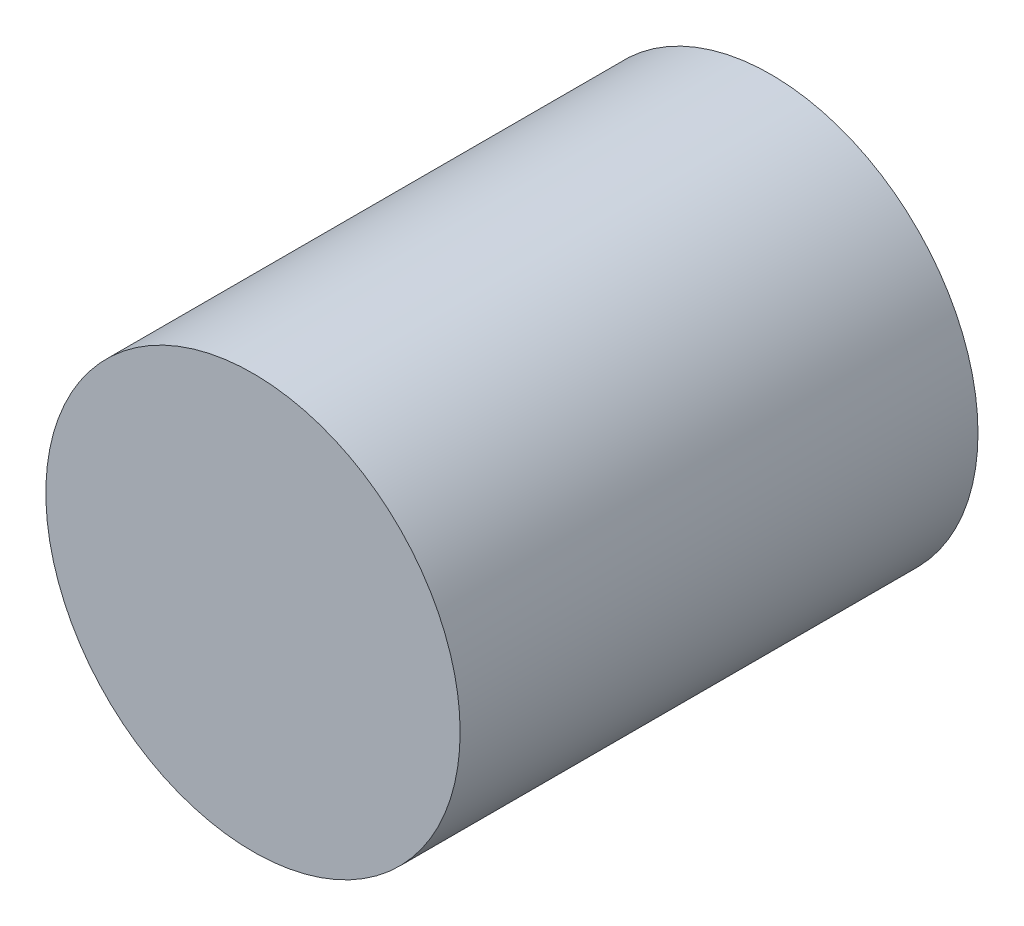
ISO-10303-21;
HEADER;
FILE_DESCRIPTION(('STEP AP214'),'2;1');
FILE_NAME('part.step','',(''),(''),'','','');
FILE_SCHEMA(('AUTOMOTIVE_DESIGN { 1 0 10303 214 1 1 1 1 }'));
ENDSEC;
DATA;
#1=APPLICATION_CONTEXT('core data for automotive mechanical design processes');
#2=APPLICATION_PROTOCOL_DEFINITION('international standard','automotive_design',2000,#1);
#3=PRODUCT_CONTEXT('',#1,'mechanical');
#4=PRODUCT('Part','Part','',(#3));
#5=PRODUCT_RELATED_PRODUCT_CATEGORY('part','',(#4));
#6=PRODUCT_DEFINITION_FORMATION('','',#4);
#7=PRODUCT_DEFINITION_CONTEXT('part definition',#1,'design');
#8=PRODUCT_DEFINITION('design','',#6,#7);
#9=PRODUCT_DEFINITION_SHAPE('','',#8);
#10=(LENGTH_UNIT() NAMED_UNIT(*) SI_UNIT(.MILLI.,.METRE.));
#11=(NAMED_UNIT(*) PLANE_ANGLE_UNIT() SI_UNIT($,.RADIAN.));
#12=(NAMED_UNIT(*) SI_UNIT($,.STERADIAN.) SOLID_ANGLE_UNIT());
#13=UNCERTAINTY_MEASURE_WITH_UNIT(LENGTH_MEASURE(1.E-05),#10,'distance_accuracy_value','');
#14=(GEOMETRIC_REPRESENTATION_CONTEXT(3) GLOBAL_UNCERTAINTY_ASSIGNED_CONTEXT((#13)) GLOBAL_UNIT_ASSIGNED_CONTEXT((#10,
#11,#12)) REPRESENTATION_CONTEXT('',''));
#15=CARTESIAN_POINT('',(0.,0.,0.));
#16=DIRECTION('',(0.,0.,1.));
#17=DIRECTION('',(1.,0.,0.));
#18=AXIS2_PLACEMENT_3D('',#15,#16,#17);
#19=CARTESIAN_POINT('',(-15.067024343169,-8.81581211568398,100.));
#20=DIRECTION('',(0.,0.,-1.));
#21=DIRECTION('',(-1.,0.,0.));
#22=AXIS2_PLACEMENT_3D('',#19,#20,#21);
#23=CYLINDRICAL_SURFACE('',#22,40.);
#24=CARTESIAN_POINT('',(-15.067024343169,-8.81581211568398,100.));
#25=DIRECTION('',(0.,0.,1.));
#26=DIRECTION('',(1.,0.,0.));
#27=AXIS2_PLACEMENT_3D('',#24,#25,#26);
#28=CIRCLE('',#27,40.);
#29=CARTESIAN_POINT('',(24.932975656831,-8.81581211568398,100.));
#30=VERTEX_POINT('',#29);
#31=EDGE_CURVE('E10',#30,#30,#28,.T.);
#32=ORIENTED_EDGE('',*,*,#31,.F.);
#33=EDGE_LOOP('',(#32));
#34=FACE_BOUND('',#33,.T.);
#35=CARTESIAN_POINT('',(-15.067024343169,-8.81581211568398,0.));
#36=DIRECTION('',(0.,0.,1.));
#37=DIRECTION('',(1.,0.,0.));
#38=AXIS2_PLACEMENT_3D('',#35,#36,#37);
#39=CIRCLE('',#38,40.);
#40=CARTESIAN_POINT('',(24.932975656831,-8.81581211568398,0.));
#41=VERTEX_POINT('',#40);
#42=EDGE_CURVE('E34',#41,#41,#39,.T.);
#43=ORIENTED_EDGE('',*,*,#42,.T.);
#44=EDGE_LOOP('',(#43));
#45=FACE_BOUND('',#44,.T.);
#46=ADVANCED_FACE('F31',(#34,#45),#23,.T.);
#47=CARTESIAN_POINT('',(-15.067024343169,-8.81581211568398,100.));
#48=DIRECTION('',(0.,0.,1.));
#49=DIRECTION('',(1.,0.,0.));
#50=AXIS2_PLACEMENT_3D('',#47,#48,#49);
#51=PLANE('',#50);
#52=ORIENTED_EDGE('',*,*,#31,.T.);
#53=EDGE_LOOP('',(#52));
#54=FACE_BOUND('',#53,.T.);
#55=ADVANCED_FACE('F46',(#54),#51,.T.);
#56=CARTESIAN_POINT('',(-15.067024343169,-8.81581211568398,0.));
#57=DIRECTION('',(0.,0.,1.));
#58=DIRECTION('',(1.,0.,0.));
#59=AXIS2_PLACEMENT_3D('',#56,#57,#58);
#60=PLANE('',#59);
#61=ORIENTED_EDGE('',*,*,#42,.F.);
#62=EDGE_LOOP('',(#61));
#63=FACE_BOUND('',#62,.T.);
#64=ADVANCED_FACE('F44',(#63),#60,.F.);
#65=CLOSED_SHELL('',(#46,#55,#64));
#66=MANIFOLD_SOLID_BREP('B2',#65);
#67=ADVANCED_BREP_SHAPE_REPRESENTATION('',(#18,#66),#14);
#68=SHAPE_DEFINITION_REPRESENTATION(#9,#67);
ENDSEC;
END-ISO-10303-21;
